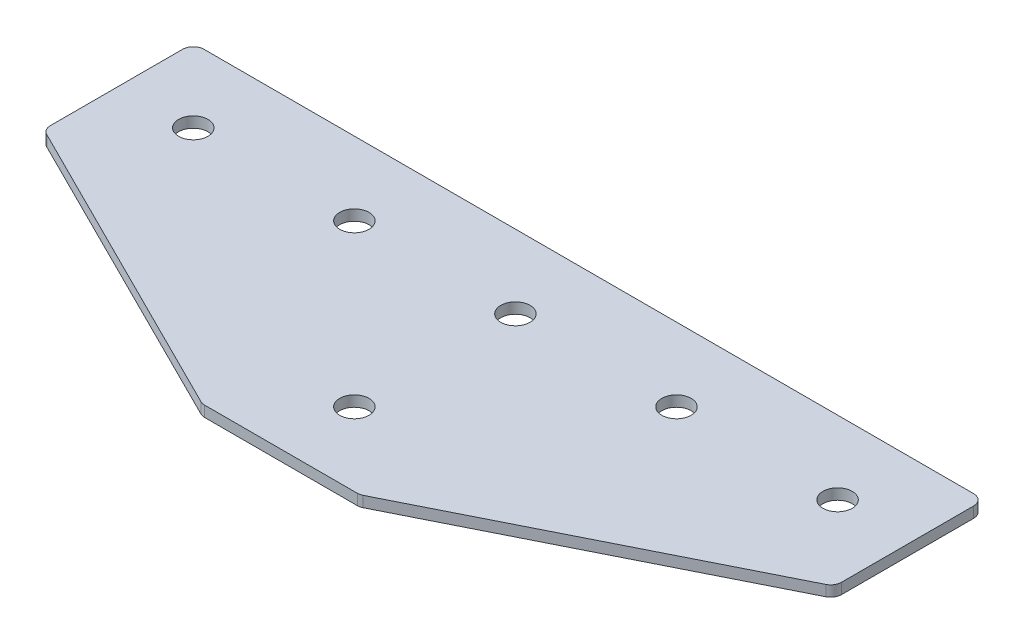
ISO-10303-21;
HEADER;
FILE_DESCRIPTION(('STEP AP214'),'2;1');
FILE_NAME('part.step','',(''),(''),'','','');
FILE_SCHEMA(('AUTOMOTIVE_DESIGN { 1 0 10303 214 1 1 1 1 }'));
ENDSEC;
DATA;
#1=APPLICATION_CONTEXT('core data for automotive mechanical design processes');
#2=APPLICATION_PROTOCOL_DEFINITION('international standard','automotive_design',2000,#1);
#3=PRODUCT_CONTEXT('',#1,'mechanical');
#4=PRODUCT('Part','Part','',(#3));
#5=PRODUCT_RELATED_PRODUCT_CATEGORY('part','',(#4));
#6=PRODUCT_DEFINITION_FORMATION('','',#4);
#7=PRODUCT_DEFINITION_CONTEXT('part definition',#1,'design');
#8=PRODUCT_DEFINITION('design','',#6,#7);
#9=PRODUCT_DEFINITION_SHAPE('','',#8);
#10=(LENGTH_UNIT() NAMED_UNIT(*) SI_UNIT(.MILLI.,.METRE.));
#11=(NAMED_UNIT(*) PLANE_ANGLE_UNIT() SI_UNIT($,.RADIAN.));
#12=(NAMED_UNIT(*) SI_UNIT($,.STERADIAN.) SOLID_ANGLE_UNIT());
#13=UNCERTAINTY_MEASURE_WITH_UNIT(LENGTH_MEASURE(1.E-05),#10,'distance_accuracy_value','');
#14=(GEOMETRIC_REPRESENTATION_CONTEXT(3) GLOBAL_UNCERTAINTY_ASSIGNED_CONTEXT((#13)) GLOBAL_UNIT_ASSIGNED_CONTEXT((#10,
#11,#12)) REPRESENTATION_CONTEXT('',''));
#15=CARTESIAN_POINT('',(0.,0.,0.));
#16=DIRECTION('',(0.,0.,1.));
#17=DIRECTION('',(1.,0.,0.));
#18=AXIS2_PLACEMENT_3D('',#15,#16,#17);
#19=CARTESIAN_POINT('',(-1.90802493216324,0.991348310229569,-23.0829184970593));
#20=DIRECTION('',(0.,-1.,0.));
#21=DIRECTION('',(0.,0.,-1.));
#22=AXIS2_PLACEMENT_3D('',#19,#20,#21);
#23=PLANE('',#22);
#24=CARTESIAN_POINT('',(-1.90802493216324,0.991348310229569,-23.0829184970593));
#25=DIRECTION('',(0.,1.,0.));
#26=DIRECTION('',(0.,0.,1.));
#27=AXIS2_PLACEMENT_3D('',#24,#25,#26);
#28=CIRCLE('',#27,4.1);
#29=CARTESIAN_POINT('',(-1.90802493216324,0.991348310229569,-18.9829184970593));
#30=VERTEX_POINT('',#29);
#31=EDGE_CURVE('E119',#30,#30,#28,.T.);
#32=ORIENTED_EDGE('',*,*,#31,.T.);
#33=EDGE_LOOP('',(#32));
#34=FACE_BOUND('',#33,.T.);
#35=DIRECTION('',(1.,0.,0.));
#36=VECTOR('',#35,1.);
#37=CARTESIAN_POINT('',(-22.4080249321632,0.991348310229569,42.4170815029406));
#38=LINE('',#37,#36);
#39=CARTESIAN_POINT('',(-23.2276850446643,0.991348310229569,42.4170815029406));
#40=VERTEX_POINT('',#39);
#41=CARTESIAN_POINT('',(19.4116351803378,0.991348310229569,42.4170815029406));
#42=VERTEX_POINT('',#41);
#43=EDGE_CURVE('E164',#40,#42,#38,.T.);
#44=ORIENTED_EDGE('',*,*,#43,.F.);
#45=CARTESIAN_POINT('',(-23.2276850446643,0.991348310229569,39.4170815029406));
#46=DIRECTION('',(0.,1.,0.));
#47=DIRECTION('',(0.,0.,-1.));
#48=AXIS2_PLACEMENT_3D('',#45,#46,#47);
#49=CIRCLE('',#48,3.);
#50=CARTESIAN_POINT('',(-24.5693258311641,0.991348310229569,42.1003630759404));
#51=VERTEX_POINT('',#50);
#52=EDGE_CURVE('E221',#51,#40,#49,.T.);
#53=ORIENTED_EDGE('',*,*,#52,.F.);
#54=DIRECTION('',(-0.894427190999916,0.,-0.447213595499957));
#55=VECTOR('',#54,1.);
#56=CARTESIAN_POINT('',(-23.9358889771636,0.991348310229569,42.4170815029406));
#57=LINE('',#56,#55);
#58=CARTESIAN_POINT('',(-110.749665718663,0.991348310229569,-0.989806867808987));
#59=VERTEX_POINT('',#58);
#60=EDGE_CURVE('E224',#51,#59,#57,.T.);
#61=ORIENTED_EDGE('',*,*,#60,.T.);
#62=CARTESIAN_POINT('',(-109.408024932163,0.991348310229569,-3.67308844080874));
#63=DIRECTION('',(0.,1.,0.));
#64=DIRECTION('',(0.,0.,-1.));
#65=AXIS2_PLACEMENT_3D('',#62,#63,#64);
#66=CIRCLE('',#65,3.);
#67=CARTESIAN_POINT('',(-112.408024932163,0.991348310229569,-3.67308844080873));
#68=VERTEX_POINT('',#67);
#69=EDGE_CURVE('E227',#68,#59,#66,.T.);
#70=ORIENTED_EDGE('',*,*,#69,.F.);
#71=DIRECTION('',(0.,0.,-1.));
#72=VECTOR('',#71,1.);
#73=CARTESIAN_POINT('',(-112.408024932163,0.991348310229569,-1.81898647455905));
#74=LINE('',#73,#72);
#75=CARTESIAN_POINT('',(-112.408024932163,0.991348310229569,-40.5829184970594));
#76=VERTEX_POINT('',#75);
#77=EDGE_CURVE('E130',#68,#76,#74,.T.);
#78=ORIENTED_EDGE('',*,*,#77,.T.);
#79=CARTESIAN_POINT('',(-109.408024932163,0.991348310229569,-40.5829184970594));
#80=DIRECTION('',(0.,1.,0.));
#81=DIRECTION('',(0.,0.,-1.));
#82=AXIS2_PLACEMENT_3D('',#79,#80,#81);
#83=CIRCLE('',#82,3.);
#84=CARTESIAN_POINT('',(-109.408024932163,0.991348310229569,-43.5829184970594));
#85=VERTEX_POINT('',#84);
#86=EDGE_CURVE('E233',#85,#76,#83,.T.);
#87=ORIENTED_EDGE('',*,*,#86,.F.);
#88=DIRECTION('',(-1.,0.,0.));
#89=VECTOR('',#88,1.);
#90=CARTESIAN_POINT('',(108.591975067837,0.991348310229569,-43.5829184970594));
#91=LINE('',#90,#89);
#92=CARTESIAN_POINT('',(105.591975067837,0.991348310229569,-43.5829184970594));
#93=VERTEX_POINT('',#92);
#94=EDGE_CURVE('E134',#93,#85,#91,.T.);
#95=ORIENTED_EDGE('',*,*,#94,.F.);
#96=CARTESIAN_POINT('',(105.591975067837,0.991348310229569,-40.5829184970594));
#97=DIRECTION('',(0.,-1.,0.));
#98=DIRECTION('',(0.,0.,-1.));
#99=AXIS2_PLACEMENT_3D('',#96,#97,#98);
#100=CIRCLE('',#99,3.);
#101=CARTESIAN_POINT('',(108.591975067837,0.991348310229569,-40.5829184970594));
#102=VERTEX_POINT('',#101);
#103=EDGE_CURVE('E185',#93,#102,#100,.T.);
#104=ORIENTED_EDGE('',*,*,#103,.T.);
#105=DIRECTION('',(0.,0.,-1.));
#106=VECTOR('',#105,1.);
#107=CARTESIAN_POINT('',(108.591975067837,0.991348310229569,-1.81898647455907));
#108=LINE('',#107,#106);
#109=CARTESIAN_POINT('',(108.591975067837,0.991348310229569,-3.67308844080876));
#110=VERTEX_POINT('',#109);
#111=EDGE_CURVE('E169',#110,#102,#108,.T.);
#112=ORIENTED_EDGE('',*,*,#111,.F.);
#113=CARTESIAN_POINT('',(105.591975067837,0.991348310229569,-3.67308844080876));
#114=DIRECTION('',(0.,-1.,0.));
#115=DIRECTION('',(0.,0.,-1.));
#116=AXIS2_PLACEMENT_3D('',#113,#114,#115);
#117=CIRCLE('',#116,3.);
#118=CARTESIAN_POINT('',(106.933615854337,0.991348310229569,-0.989806867809015));
#119=VERTEX_POINT('',#118);
#120=EDGE_CURVE('E31',#110,#119,#117,.T.);
#121=ORIENTED_EDGE('',*,*,#120,.T.);
#122=DIRECTION('',(0.894427190999916,0.,-0.447213595499957));
#123=VECTOR('',#122,1.);
#124=CARTESIAN_POINT('',(20.1198391128372,0.991348310229569,42.4170815029406));
#125=LINE('',#124,#123);
#126=CARTESIAN_POINT('',(20.7532759668377,0.991348310229569,42.1003630759404));
#127=VERTEX_POINT('',#126);
#128=EDGE_CURVE('E167',#127,#119,#125,.T.);
#129=ORIENTED_EDGE('',*,*,#128,.F.);
#130=CARTESIAN_POINT('',(19.4116351803378,0.991348310229569,39.4170815029406));
#131=DIRECTION('',(0.,-1.,0.));
#132=DIRECTION('',(0.,0.,-1.));
#133=AXIS2_PLACEMENT_3D('',#130,#131,#132);
#134=CIRCLE('',#133,3.);
#135=EDGE_CURVE('E188',#127,#42,#134,.T.);
#136=ORIENTED_EDGE('',*,*,#135,.T.);
#137=EDGE_LOOP('',(#44,#53,#61,#70,#78,#87,#95,#104,#112,#121,#129,#136));
#138=FACE_BOUND('',#137,.T.);
#139=CARTESIAN_POINT('',(-1.90802493216325,0.991348310229569,21.9170815029407));
#140=DIRECTION('',(0.,1.,0.));
#141=DIRECTION('',(0.,0.,1.));
#142=AXIS2_PLACEMENT_3D('',#139,#140,#141);
#143=CIRCLE('',#142,4.1);
#144=CARTESIAN_POINT('',(-1.90802493216325,0.991348310229569,26.0170815029407));
#145=VERTEX_POINT('',#144);
#146=EDGE_CURVE('E147',#145,#145,#143,.T.);
#147=ORIENTED_EDGE('',*,*,#146,.T.);
#148=EDGE_LOOP('',(#147));
#149=FACE_BOUND('',#148,.T.);
#150=CARTESIAN_POINT('',(88.0919750678368,0.991348310229569,-23.0829184970593));
#151=DIRECTION('',(0.,1.,0.));
#152=DIRECTION('',(0.,0.,1.));
#153=AXIS2_PLACEMENT_3D('',#150,#151,#152);
#154=CIRCLE('',#153,4.09999999999999);
#155=CARTESIAN_POINT('',(88.0919750678368,0.991348310229569,-18.9829184970593));
#156=VERTEX_POINT('',#155);
#157=EDGE_CURVE('E139',#156,#156,#154,.T.);
#158=ORIENTED_EDGE('',*,*,#157,.T.);
#159=EDGE_LOOP('',(#158));
#160=FACE_BOUND('',#159,.T.);
#161=CARTESIAN_POINT('',(43.0919750678368,0.991348310229569,-23.0829184970593));
#162=DIRECTION('',(0.,1.,0.));
#163=DIRECTION('',(0.,0.,1.));
#164=AXIS2_PLACEMENT_3D('',#161,#162,#163);
#165=CIRCLE('',#164,4.1);
#166=CARTESIAN_POINT('',(43.0919750678368,0.991348310229569,-18.9829184970593));
#167=VERTEX_POINT('',#166);
#168=EDGE_CURVE('E153',#167,#167,#165,.T.);
#169=ORIENTED_EDGE('',*,*,#168,.T.);
#170=EDGE_LOOP('',(#169));
#171=FACE_BOUND('',#170,.T.);
#172=CARTESIAN_POINT('',(-91.9080249321632,0.991348310229569,-23.0829184970593));
#173=DIRECTION('',(0.,-1.,0.));
#174=DIRECTION('',(0.,0.,1.));
#175=AXIS2_PLACEMENT_3D('',#172,#173,#174);
#176=CIRCLE('',#175,4.09999999999999);
#177=CARTESIAN_POINT('',(-91.9080249321632,0.991348310229569,-18.9829184970593));
#178=VERTEX_POINT('',#177);
#179=EDGE_CURVE('E423',#178,#178,#176,.T.);
#180=ORIENTED_EDGE('',*,*,#179,.F.);
#181=EDGE_LOOP('',(#180));
#182=FACE_BOUND('',#181,.T.);
#183=CARTESIAN_POINT('',(-46.9080249321632,0.991348310229569,-23.0829184970593));
#184=DIRECTION('',(0.,-1.,0.));
#185=DIRECTION('',(0.,0.,1.));
#186=AXIS2_PLACEMENT_3D('',#183,#184,#185);
#187=CIRCLE('',#186,4.1);
#188=CARTESIAN_POINT('',(-46.9080249321632,0.991348310229569,-18.9829184970593));
#189=VERTEX_POINT('',#188);
#190=EDGE_CURVE('E254',#189,#189,#187,.T.);
#191=ORIENTED_EDGE('',*,*,#190,.F.);
#192=EDGE_LOOP('',(#191));
#193=FACE_BOUND('',#192,.T.);
#194=ADVANCED_FACE('F16',(#34,#138,#149,#160,#171,#182,#193),#23,.T.);
#195=CARTESIAN_POINT('',(108.591975067837,0.991348310229569,-43.5829184970594));
#196=DIRECTION('',(0.,0.,-1.));
#197=DIRECTION('',(-1.,0.,0.));
#198=AXIS2_PLACEMENT_3D('',#195,#196,#197);
#199=PLANE('',#198);
#200=ORIENTED_EDGE('',*,*,#94,.T.);
#201=DIRECTION('',(0.,1.,0.));
#202=VECTOR('',#201,1.);
#203=CARTESIAN_POINT('',(-109.408024932163,0.991348310229569,-43.5829184970594));
#204=LINE('',#203,#202);
#205=CARTESIAN_POINT('',(-109.408024932163,3.99134831022957,-43.5829184970594));
#206=VERTEX_POINT('',#205);
#207=EDGE_CURVE('E125',#206,#85,#204,.F.);
#208=ORIENTED_EDGE('',*,*,#207,.F.);
#209=DIRECTION('',(-1.,0.,0.));
#210=VECTOR('',#209,1.);
#211=CARTESIAN_POINT('',(108.591975067837,3.99134831022957,-43.5829184970594));
#212=LINE('',#211,#210);
#213=CARTESIAN_POINT('',(105.591975067837,3.99134831022957,-43.5829184970594));
#214=VERTEX_POINT('',#213);
#215=EDGE_CURVE('E105',#214,#206,#212,.T.);
#216=ORIENTED_EDGE('',*,*,#215,.F.);
#217=DIRECTION('',(0.,1.,0.));
#218=VECTOR('',#217,1.);
#219=CARTESIAN_POINT('',(105.591975067837,0.991348310229569,-43.5829184970594));
#220=LINE('',#219,#218);
#221=EDGE_CURVE('E10',#214,#93,#220,.F.);
#222=ORIENTED_EDGE('',*,*,#221,.T.);
#223=EDGE_LOOP('',(#200,#208,#216,#222));
#224=FACE_BOUND('',#223,.T.);
#225=ADVANCED_FACE('F132',(#224),#199,.T.);
#226=CARTESIAN_POINT('',(108.591975067837,0.991348310229569,-1.81898647455907));
#227=DIRECTION('',(1.,0.,0.));
#228=DIRECTION('',(0.,0.,-1.));
#229=AXIS2_PLACEMENT_3D('',#226,#227,#228);
#230=PLANE('',#229);
#231=DIRECTION('',(0.,0.,-1.));
#232=VECTOR('',#231,1.);
#233=CARTESIAN_POINT('',(108.591975067837,3.99134831022957,-1.81898647455907));
#234=LINE('',#233,#232);
#235=CARTESIAN_POINT('',(108.591975067837,3.99134831022957,-3.67308844080876));
#236=VERTEX_POINT('',#235);
#237=CARTESIAN_POINT('',(108.591975067837,3.99134831022957,-40.5829184970594));
#238=VERTEX_POINT('',#237);
#239=EDGE_CURVE('E165',#236,#238,#234,.T.);
#240=ORIENTED_EDGE('',*,*,#239,.F.);
#241=DIRECTION('',(0.,1.,0.));
#242=VECTOR('',#241,1.);
#243=CARTESIAN_POINT('',(108.591975067837,0.991348310229569,-3.67308844080876));
#244=LINE('',#243,#242);
#245=EDGE_CURVE('E24',#236,#110,#244,.F.);
#246=ORIENTED_EDGE('',*,*,#245,.T.);
#247=ORIENTED_EDGE('',*,*,#111,.T.);
#248=DIRECTION('',(0.,1.,0.));
#249=VECTOR('',#248,1.);
#250=CARTESIAN_POINT('',(108.591975067837,0.991348310229569,-40.5829184970594));
#251=LINE('',#250,#249);
#252=EDGE_CURVE('E195',#102,#238,#251,.T.);
#253=ORIENTED_EDGE('',*,*,#252,.T.);
#254=EDGE_LOOP('',(#240,#246,#247,#253));
#255=FACE_BOUND('',#254,.T.);
#256=ADVANCED_FACE('F200',(#255),#230,.T.);
#257=CARTESIAN_POINT('',(20.1198391128372,0.991348310229569,42.4170815029406));
#258=DIRECTION('',(0.447213595499957,0.,0.894427190999916));
#259=DIRECTION('',(0.894427190999916,0.,-0.447213595499957));
#260=AXIS2_PLACEMENT_3D('',#257,#258,#259);
#261=PLANE('',#260);
#262=DIRECTION('',(0.894427190999916,0.,-0.447213595499957));
#263=VECTOR('',#262,1.);
#264=CARTESIAN_POINT('',(20.1198391128372,3.99134831022957,42.4170815029406));
#265=LINE('',#264,#263);
#266=CARTESIAN_POINT('',(20.7532759668377,3.99134831022957,42.1003630759404));
#267=VERTEX_POINT('',#266);
#268=CARTESIAN_POINT('',(106.933615854337,3.99134831022957,-0.989806867809015));
#269=VERTEX_POINT('',#268);
#270=EDGE_CURVE('E173',#267,#269,#265,.T.);
#271=ORIENTED_EDGE('',*,*,#270,.F.);
#272=DIRECTION('',(0.,1.,0.));
#273=VECTOR('',#272,1.);
#274=CARTESIAN_POINT('',(20.7532759668377,0.991348310229569,42.1003630759404));
#275=LINE('',#274,#273);
#276=EDGE_CURVE('E38',#267,#127,#275,.F.);
#277=ORIENTED_EDGE('',*,*,#276,.T.);
#278=ORIENTED_EDGE('',*,*,#128,.T.);
#279=DIRECTION('',(0.,1.,0.));
#280=VECTOR('',#279,1.);
#281=CARTESIAN_POINT('',(106.933615854337,0.991348310229569,-0.989806867809015));
#282=LINE('',#281,#280);
#283=EDGE_CURVE('E191',#119,#269,#282,.T.);
#284=ORIENTED_EDGE('',*,*,#283,.T.);
#285=EDGE_LOOP('',(#271,#277,#278,#284));
#286=FACE_BOUND('',#285,.T.);
#287=ADVANCED_FACE('F207',(#286),#261,.T.);
#288=CARTESIAN_POINT('',(-22.4080249321632,0.991348310229569,42.4170815029406));
#289=DIRECTION('',(0.,0.,1.));
#290=DIRECTION('',(1.,0.,0.));
#291=AXIS2_PLACEMENT_3D('',#288,#289,#290);
#292=PLANE('',#291);
#293=DIRECTION('',(1.,0.,0.));
#294=VECTOR('',#293,1.);
#295=CARTESIAN_POINT('',(-22.4080249321632,3.99134831022957,42.4170815029406));
#296=LINE('',#295,#294);
#297=CARTESIAN_POINT('',(-23.2276850446643,3.99134831022957,42.4170815029406));
#298=VERTEX_POINT('',#297);
#299=CARTESIAN_POINT('',(19.4116351803378,3.99134831022957,42.4170815029406));
#300=VERTEX_POINT('',#299);
#301=EDGE_CURVE('E118',#298,#300,#296,.T.);
#302=ORIENTED_EDGE('',*,*,#301,.F.);
#303=DIRECTION('',(0.,1.,0.));
#304=VECTOR('',#303,1.);
#305=CARTESIAN_POINT('',(-23.2276850446643,0.991348310229569,42.4170815029406));
#306=LINE('',#305,#304);
#307=EDGE_CURVE('E217',#40,#298,#306,.T.);
#308=ORIENTED_EDGE('',*,*,#307,.F.);
#309=ORIENTED_EDGE('',*,*,#43,.T.);
#310=DIRECTION('',(0.,1.,0.));
#311=VECTOR('',#310,1.);
#312=CARTESIAN_POINT('',(19.4116351803378,0.991348310229569,42.4170815029406));
#313=LINE('',#312,#311);
#314=EDGE_CURVE('E182',#42,#300,#313,.T.);
#315=ORIENTED_EDGE('',*,*,#314,.T.);
#316=EDGE_LOOP('',(#302,#308,#309,#315));
#317=FACE_BOUND('',#316,.T.);
#318=ADVANCED_FACE('F214',(#317),#292,.T.);
#319=CARTESIAN_POINT('',(-1.90802493216324,3.99134831022957,-23.0829184970593));
#320=DIRECTION('',(0.,-1.,0.));
#321=DIRECTION('',(0.,0.,-1.));
#322=AXIS2_PLACEMENT_3D('',#319,#320,#321);
#323=PLANE('',#322);
#324=CARTESIAN_POINT('',(-1.90802493216324,3.99134831022957,-23.0829184970593));
#325=DIRECTION('',(0.,1.,0.));
#326=DIRECTION('',(0.,0.,1.));
#327=AXIS2_PLACEMENT_3D('',#324,#325,#326);
#328=CIRCLE('',#327,4.1);
#329=CARTESIAN_POINT('',(-1.90802493216324,3.99134831022957,-18.9829184970593));
#330=VERTEX_POINT('',#329);
#331=EDGE_CURVE('E156',#330,#330,#328,.T.);
#332=ORIENTED_EDGE('',*,*,#331,.F.);
#333=EDGE_LOOP('',(#332));
#334=FACE_BOUND('',#333,.T.);
#335=CARTESIAN_POINT('',(-23.2276850446643,3.99134831022957,39.4170815029406));
#336=DIRECTION('',(0.,1.,0.));
#337=DIRECTION('',(0.,0.,-1.));
#338=AXIS2_PLACEMENT_3D('',#335,#336,#337);
#339=CIRCLE('',#338,3.);
#340=CARTESIAN_POINT('',(-24.5693258311641,3.99134831022957,42.1003630759404));
#341=VERTEX_POINT('',#340);
#342=EDGE_CURVE('E239',#298,#341,#339,.F.);
#343=ORIENTED_EDGE('',*,*,#342,.F.);
#344=ORIENTED_EDGE('',*,*,#301,.T.);
#345=CARTESIAN_POINT('',(19.4116351803378,3.99134831022957,39.4170815029406));
#346=DIRECTION('',(0.,-1.,0.));
#347=DIRECTION('',(0.,0.,-1.));
#348=AXIS2_PLACEMENT_3D('',#345,#346,#347);
#349=CIRCLE('',#348,3.);
#350=EDGE_CURVE('E180',#300,#267,#349,.F.);
#351=ORIENTED_EDGE('',*,*,#350,.T.);
#352=ORIENTED_EDGE('',*,*,#270,.T.);
#353=CARTESIAN_POINT('',(105.591975067837,3.99134831022957,-3.67308844080876));
#354=DIRECTION('',(0.,-1.,0.));
#355=DIRECTION('',(0.,0.,-1.));
#356=AXIS2_PLACEMENT_3D('',#353,#354,#355);
#357=CIRCLE('',#356,3.);
#358=EDGE_CURVE('E178',#269,#236,#357,.F.);
#359=ORIENTED_EDGE('',*,*,#358,.T.);
#360=ORIENTED_EDGE('',*,*,#239,.T.);
#361=CARTESIAN_POINT('',(105.591975067837,3.99134831022957,-40.5829184970594));
#362=DIRECTION('',(0.,-1.,0.));
#363=DIRECTION('',(0.,0.,-1.));
#364=AXIS2_PLACEMENT_3D('',#361,#362,#363);
#365=CIRCLE('',#364,3.);
#366=EDGE_CURVE('E114',#238,#214,#365,.F.);
#367=ORIENTED_EDGE('',*,*,#366,.T.);
#368=ORIENTED_EDGE('',*,*,#215,.T.);
#369=CARTESIAN_POINT('',(-109.408024932163,3.99134831022957,-40.5829184970594));
#370=DIRECTION('',(0.,1.,0.));
#371=DIRECTION('',(0.,0.,-1.));
#372=AXIS2_PLACEMENT_3D('',#369,#370,#371);
#373=CIRCLE('',#372,3.);
#374=CARTESIAN_POINT('',(-112.408024932163,3.99134831022957,-40.5829184970594));
#375=VERTEX_POINT('',#374);
#376=EDGE_CURVE('E111',#375,#206,#373,.F.);
#377=ORIENTED_EDGE('',*,*,#376,.F.);
#378=DIRECTION('',(0.,0.,-1.));
#379=VECTOR('',#378,1.);
#380=CARTESIAN_POINT('',(-112.408024932163,3.99134831022957,-1.81898647455905));
#381=LINE('',#380,#379);
#382=CARTESIAN_POINT('',(-112.408024932163,3.99134831022957,-3.67308844080873));
#383=VERTEX_POINT('',#382);
#384=EDGE_CURVE('E244',#383,#375,#381,.T.);
#385=ORIENTED_EDGE('',*,*,#384,.F.);
#386=CARTESIAN_POINT('',(-109.408024932163,3.99134831022957,-3.67308844080874));
#387=DIRECTION('',(0.,1.,0.));
#388=DIRECTION('',(0.,0.,-1.));
#389=AXIS2_PLACEMENT_3D('',#386,#387,#388);
#390=CIRCLE('',#389,3.);
#391=CARTESIAN_POINT('',(-110.749665718663,3.99134831022957,-0.989806867808987));
#392=VERTEX_POINT('',#391);
#393=EDGE_CURVE('E129',#392,#383,#390,.F.);
#394=ORIENTED_EDGE('',*,*,#393,.F.);
#395=DIRECTION('',(-0.894427190999916,0.,-0.447213595499957));
#396=VECTOR('',#395,1.);
#397=CARTESIAN_POINT('',(-23.9358889771636,3.99134831022957,42.4170815029406));
#398=LINE('',#397,#396);
#399=EDGE_CURVE('E248',#341,#392,#398,.T.);
#400=ORIENTED_EDGE('',*,*,#399,.F.);
#401=EDGE_LOOP('',(#343,#344,#351,#352,#359,#360,#367,#368,#377,#385,#394,#400));
#402=FACE_BOUND('',#401,.T.);
#403=CARTESIAN_POINT('',(88.0919750678368,3.99134831022957,-23.0829184970593));
#404=DIRECTION('',(0.,1.,0.));
#405=DIRECTION('',(0.,0.,1.));
#406=AXIS2_PLACEMENT_3D('',#403,#404,#405);
#407=CIRCLE('',#406,4.09999999999999);
#408=CARTESIAN_POINT('',(88.0919750678368,3.99134831022957,-18.9829184970593));
#409=VERTEX_POINT('',#408);
#410=EDGE_CURVE('E135',#409,#409,#407,.T.);
#411=ORIENTED_EDGE('',*,*,#410,.F.);
#412=EDGE_LOOP('',(#411));
#413=FACE_BOUND('',#412,.T.);
#414=CARTESIAN_POINT('',(43.0919750678368,3.99134831022957,-23.0829184970593));
#415=DIRECTION('',(0.,1.,0.));
#416=DIRECTION('',(0.,0.,1.));
#417=AXIS2_PLACEMENT_3D('',#414,#415,#416);
#418=CIRCLE('',#417,4.1);
#419=CARTESIAN_POINT('',(43.0919750678368,3.99134831022957,-18.9829184970593));
#420=VERTEX_POINT('',#419);
#421=EDGE_CURVE('E150',#420,#420,#418,.T.);
#422=ORIENTED_EDGE('',*,*,#421,.F.);
#423=EDGE_LOOP('',(#422));
#424=FACE_BOUND('',#423,.T.);
#425=CARTESIAN_POINT('',(-1.90802493216325,3.99134831022957,21.9170815029407));
#426=DIRECTION('',(0.,1.,0.));
#427=DIRECTION('',(0.,0.,1.));
#428=AXIS2_PLACEMENT_3D('',#425,#426,#427);
#429=CIRCLE('',#428,4.1);
#430=CARTESIAN_POINT('',(-1.90802493216325,3.99134831022957,26.0170815029407));
#431=VERTEX_POINT('',#430);
#432=EDGE_CURVE('E145',#431,#431,#429,.T.);
#433=ORIENTED_EDGE('',*,*,#432,.F.);
#434=EDGE_LOOP('',(#433));
#435=FACE_BOUND('',#434,.T.);
#436=CARTESIAN_POINT('',(-91.9080249321632,3.99134831022957,-23.0829184970593));
#437=DIRECTION('',(0.,-1.,0.));
#438=DIRECTION('',(0.,0.,1.));
#439=AXIS2_PLACEMENT_3D('',#436,#437,#438);
#440=CIRCLE('',#439,4.09999999999999);
#441=CARTESIAN_POINT('',(-91.9080249321632,3.99134831022957,-18.9829184970593));
#442=VERTEX_POINT('',#441);
#443=EDGE_CURVE('E426',#442,#442,#440,.T.);
#444=ORIENTED_EDGE('',*,*,#443,.T.);
#445=EDGE_LOOP('',(#444));
#446=FACE_BOUND('',#445,.T.);
#447=CARTESIAN_POINT('',(-46.9080249321632,3.99134831022957,-23.0829184970593));
#448=DIRECTION('',(0.,-1.,0.));
#449=DIRECTION('',(0.,0.,1.));
#450=AXIS2_PLACEMENT_3D('',#447,#448,#449);
#451=CIRCLE('',#450,4.1);
#452=CARTESIAN_POINT('',(-46.9080249321632,3.99134831022957,-18.9829184970593));
#453=VERTEX_POINT('',#452);
#454=EDGE_CURVE('E251',#453,#453,#451,.T.);
#455=ORIENTED_EDGE('',*,*,#454,.T.);
#456=EDGE_LOOP('',(#455));
#457=FACE_BOUND('',#456,.T.);
#458=ADVANCED_FACE('F108',(#334,#402,#413,#424,#435,#446,#457),#323,.F.);
#459=CARTESIAN_POINT('',(19.4116351803378,0.991348310229569,39.4170815029406));
#460=DIRECTION('',(0.,1.,0.));
#461=DIRECTION('',(0.,0.,1.));
#462=AXIS2_PLACEMENT_3D('',#459,#460,#461);
#463=CYLINDRICAL_SURFACE('',#462,3.);
#464=ORIENTED_EDGE('',*,*,#135,.F.);
#465=ORIENTED_EDGE('',*,*,#276,.F.);
#466=ORIENTED_EDGE('',*,*,#350,.F.);
#467=ORIENTED_EDGE('',*,*,#314,.F.);
#468=EDGE_LOOP('',(#464,#465,#466,#467));
#469=FACE_BOUND('',#468,.T.);
#470=ADVANCED_FACE('F212',(#469),#463,.T.);
#471=CARTESIAN_POINT('',(105.591975067837,0.991348310229569,-3.67308844080876));
#472=DIRECTION('',(0.,1.,0.));
#473=DIRECTION('',(0.,0.,1.));
#474=AXIS2_PLACEMENT_3D('',#471,#472,#473);
#475=CYLINDRICAL_SURFACE('',#474,3.);
#476=ORIENTED_EDGE('',*,*,#120,.F.);
#477=ORIENTED_EDGE('',*,*,#245,.F.);
#478=ORIENTED_EDGE('',*,*,#358,.F.);
#479=ORIENTED_EDGE('',*,*,#283,.F.);
#480=EDGE_LOOP('',(#476,#477,#478,#479));
#481=FACE_BOUND('',#480,.T.);
#482=ADVANCED_FACE('F206',(#481),#475,.T.);
#483=CARTESIAN_POINT('',(105.591975067837,0.991348310229569,-40.5829184970594));
#484=DIRECTION('',(0.,1.,0.));
#485=DIRECTION('',(0.,0.,1.));
#486=AXIS2_PLACEMENT_3D('',#483,#484,#485);
#487=CYLINDRICAL_SURFACE('',#486,3.);
#488=ORIENTED_EDGE('',*,*,#103,.F.);
#489=ORIENTED_EDGE('',*,*,#221,.F.);
#490=ORIENTED_EDGE('',*,*,#366,.F.);
#491=ORIENTED_EDGE('',*,*,#252,.F.);
#492=EDGE_LOOP('',(#488,#489,#490,#491));
#493=FACE_BOUND('',#492,.T.);
#494=ADVANCED_FACE('F18',(#493),#487,.T.);
#495=CARTESIAN_POINT('',(-1.90802493216324,0.991348310229569,-23.0829184970593));
#496=DIRECTION('',(0.,1.,0.));
#497=DIRECTION('',(0.,0.,1.));
#498=AXIS2_PLACEMENT_3D('',#495,#496,#497);
#499=CYLINDRICAL_SURFACE('',#498,4.1);
#500=ORIENTED_EDGE('',*,*,#31,.F.);
#501=EDGE_LOOP('',(#500));
#502=FACE_BOUND('',#501,.T.);
#503=ORIENTED_EDGE('',*,*,#331,.T.);
#504=EDGE_LOOP('',(#503));
#505=FACE_BOUND('',#504,.T.);
#506=ADVANCED_FACE('F288',(#502,#505),#499,.F.);
#507=CARTESIAN_POINT('',(43.0919750678368,0.991348310229569,-23.0829184970593));
#508=DIRECTION('',(0.,1.,0.));
#509=DIRECTION('',(0.,0.,1.));
#510=AXIS2_PLACEMENT_3D('',#507,#508,#509);
#511=CYLINDRICAL_SURFACE('',#510,4.1);
#512=ORIENTED_EDGE('',*,*,#168,.F.);
#513=EDGE_LOOP('',(#512));
#514=FACE_BOUND('',#513,.T.);
#515=ORIENTED_EDGE('',*,*,#421,.T.);
#516=EDGE_LOOP('',(#515));
#517=FACE_BOUND('',#516,.T.);
#518=ADVANCED_FACE('F293',(#514,#517),#511,.F.);
#519=CARTESIAN_POINT('',(-1.90802493216325,0.991348310229569,21.9170815029407));
#520=DIRECTION('',(0.,1.,0.));
#521=DIRECTION('',(0.,0.,1.));
#522=AXIS2_PLACEMENT_3D('',#519,#520,#521);
#523=CYLINDRICAL_SURFACE('',#522,4.1);
#524=ORIENTED_EDGE('',*,*,#432,.T.);
#525=EDGE_LOOP('',(#524));
#526=FACE_BOUND('',#525,.T.);
#527=ORIENTED_EDGE('',*,*,#146,.F.);
#528=EDGE_LOOP('',(#527));
#529=FACE_BOUND('',#528,.T.);
#530=ADVANCED_FACE('F299',(#526,#529),#523,.F.);
#531=CARTESIAN_POINT('',(88.0919750678368,0.991348310229569,-23.0829184970593));
#532=DIRECTION('',(0.,1.,0.));
#533=DIRECTION('',(0.,0.,1.));
#534=AXIS2_PLACEMENT_3D('',#531,#532,#533);
#535=CYLINDRICAL_SURFACE('',#534,4.09999999999999);
#536=ORIENTED_EDGE('',*,*,#157,.F.);
#537=EDGE_LOOP('',(#536));
#538=FACE_BOUND('',#537,.T.);
#539=ORIENTED_EDGE('',*,*,#410,.T.);
#540=EDGE_LOOP('',(#539));
#541=FACE_BOUND('',#540,.T.);
#542=ADVANCED_FACE('F354',(#538,#541),#535,.F.);
#543=CARTESIAN_POINT('',(-112.408024932163,0.991348310229569,-1.81898647455905));
#544=DIRECTION('',(-1.,0.,0.));
#545=DIRECTION('',(0.,0.,-1.));
#546=AXIS2_PLACEMENT_3D('',#543,#544,#545);
#547=PLANE('',#546);
#548=ORIENTED_EDGE('',*,*,#384,.T.);
#549=DIRECTION('',(0.,1.,0.));
#550=VECTOR('',#549,1.);
#551=CARTESIAN_POINT('',(-112.408024932163,0.991348310229569,-40.5829184970594));
#552=LINE('',#551,#550);
#553=EDGE_CURVE('E127',#76,#375,#552,.T.);
#554=ORIENTED_EDGE('',*,*,#553,.F.);
#555=ORIENTED_EDGE('',*,*,#77,.F.);
#556=DIRECTION('',(0.,1.,0.));
#557=VECTOR('',#556,1.);
#558=CARTESIAN_POINT('',(-112.408024932163,0.991348310229569,-3.67308844080873));
#559=LINE('',#558,#557);
#560=EDGE_CURVE('E136',#383,#68,#559,.F.);
#561=ORIENTED_EDGE('',*,*,#560,.F.);
#562=EDGE_LOOP('',(#548,#554,#555,#561));
#563=FACE_BOUND('',#562,.T.);
#564=ADVANCED_FACE('F261',(#563),#547,.T.);
#565=CARTESIAN_POINT('',(-23.9358889771636,0.991348310229569,42.4170815029406));
#566=DIRECTION('',(-0.447213595499957,0.,0.894427190999916));
#567=DIRECTION('',(-0.894427190999917,0.,-0.447213595499957));
#568=AXIS2_PLACEMENT_3D('',#565,#566,#567);
#569=PLANE('',#568);
#570=ORIENTED_EDGE('',*,*,#399,.T.);
#571=DIRECTION('',(0.,1.,0.));
#572=VECTOR('',#571,1.);
#573=CARTESIAN_POINT('',(-110.749665718663,0.991348310229569,-0.989806867808987));
#574=LINE('',#573,#572);
#575=EDGE_CURVE('E226',#59,#392,#574,.T.);
#576=ORIENTED_EDGE('',*,*,#575,.F.);
#577=ORIENTED_EDGE('',*,*,#60,.F.);
#578=DIRECTION('',(0.,1.,0.));
#579=VECTOR('',#578,1.);
#580=CARTESIAN_POINT('',(-24.5693258311641,0.991348310229569,42.1003630759404));
#581=LINE('',#580,#579);
#582=EDGE_CURVE('E230',#341,#51,#581,.F.);
#583=ORIENTED_EDGE('',*,*,#582,.F.);
#584=EDGE_LOOP('',(#570,#576,#577,#583));
#585=FACE_BOUND('',#584,.T.);
#586=ADVANCED_FACE('F243',(#585),#569,.T.);
#587=CARTESIAN_POINT('',(-23.2276850446643,0.991348310229569,39.4170815029406));
#588=DIRECTION('',(0.,1.,0.));
#589=DIRECTION('',(0.,0.,1.));
#590=AXIS2_PLACEMENT_3D('',#587,#588,#589);
#591=CYLINDRICAL_SURFACE('',#590,3.);
#592=ORIENTED_EDGE('',*,*,#52,.T.);
#593=ORIENTED_EDGE('',*,*,#307,.T.);
#594=ORIENTED_EDGE('',*,*,#342,.T.);
#595=ORIENTED_EDGE('',*,*,#582,.T.);
#596=EDGE_LOOP('',(#592,#593,#594,#595));
#597=FACE_BOUND('',#596,.T.);
#598=ADVANCED_FACE('F238',(#597),#591,.T.);
#599=CARTESIAN_POINT('',(-109.408024932163,0.991348310229569,-3.67308844080874));
#600=DIRECTION('',(0.,1.,0.));
#601=DIRECTION('',(0.,0.,1.));
#602=AXIS2_PLACEMENT_3D('',#599,#600,#601);
#603=CYLINDRICAL_SURFACE('',#602,3.);
#604=ORIENTED_EDGE('',*,*,#69,.T.);
#605=ORIENTED_EDGE('',*,*,#575,.T.);
#606=ORIENTED_EDGE('',*,*,#393,.T.);
#607=ORIENTED_EDGE('',*,*,#560,.T.);
#608=EDGE_LOOP('',(#604,#605,#606,#607));
#609=FACE_BOUND('',#608,.T.);
#610=ADVANCED_FACE('F263',(#609),#603,.T.);
#611=CARTESIAN_POINT('',(-109.408024932163,0.991348310229569,-40.5829184970594));
#612=DIRECTION('',(0.,1.,0.));
#613=DIRECTION('',(0.,0.,1.));
#614=AXIS2_PLACEMENT_3D('',#611,#612,#613);
#615=CYLINDRICAL_SURFACE('',#614,3.);
#616=ORIENTED_EDGE('',*,*,#86,.T.);
#617=ORIENTED_EDGE('',*,*,#553,.T.);
#618=ORIENTED_EDGE('',*,*,#376,.T.);
#619=ORIENTED_EDGE('',*,*,#207,.T.);
#620=EDGE_LOOP('',(#616,#617,#618,#619));
#621=FACE_BOUND('',#620,.T.);
#622=ADVANCED_FACE('F124',(#621),#615,.T.);
#623=CARTESIAN_POINT('',(-46.9080249321632,0.991348310229569,-23.0829184970593));
#624=DIRECTION('',(0.,1.,0.));
#625=DIRECTION('',(0.,0.,1.));
#626=AXIS2_PLACEMENT_3D('',#623,#624,#625);
#627=CYLINDRICAL_SURFACE('',#626,4.1);
#628=ORIENTED_EDGE('',*,*,#190,.T.);
#629=EDGE_LOOP('',(#628));
#630=FACE_BOUND('',#629,.T.);
#631=ORIENTED_EDGE('',*,*,#454,.F.);
#632=EDGE_LOOP('',(#631));
#633=FACE_BOUND('',#632,.T.);
#634=ADVANCED_FACE('F271',(#630,#633),#627,.F.);
#635=CARTESIAN_POINT('',(-91.9080249321632,0.991348310229569,-23.0829184970593));
#636=DIRECTION('',(0.,1.,0.));
#637=DIRECTION('',(0.,0.,1.));
#638=AXIS2_PLACEMENT_3D('',#635,#636,#637);
#639=CYLINDRICAL_SURFACE('',#638,4.09999999999999);
#640=ORIENTED_EDGE('',*,*,#179,.T.);
#641=EDGE_LOOP('',(#640));
#642=FACE_BOUND('',#641,.T.);
#643=ORIENTED_EDGE('',*,*,#443,.F.);
#644=EDGE_LOOP('',(#643));
#645=FACE_BOUND('',#644,.T.);
#646=ADVANCED_FACE('F404',(#642,#645),#639,.F.);
#647=CLOSED_SHELL('',(#194,#225,#256,#287,#318,#458,#470,#482,#494,#506,#518,#530,#542,#564,
#586,#598,#610,#622,#634,#646));
#648=MANIFOLD_SOLID_BREP('B1',#647);
#649=ADVANCED_BREP_SHAPE_REPRESENTATION('',(#18,#648),#14);
#650=SHAPE_DEFINITION_REPRESENTATION(#9,#649);
ENDSEC;
END-ISO-10303-21;
